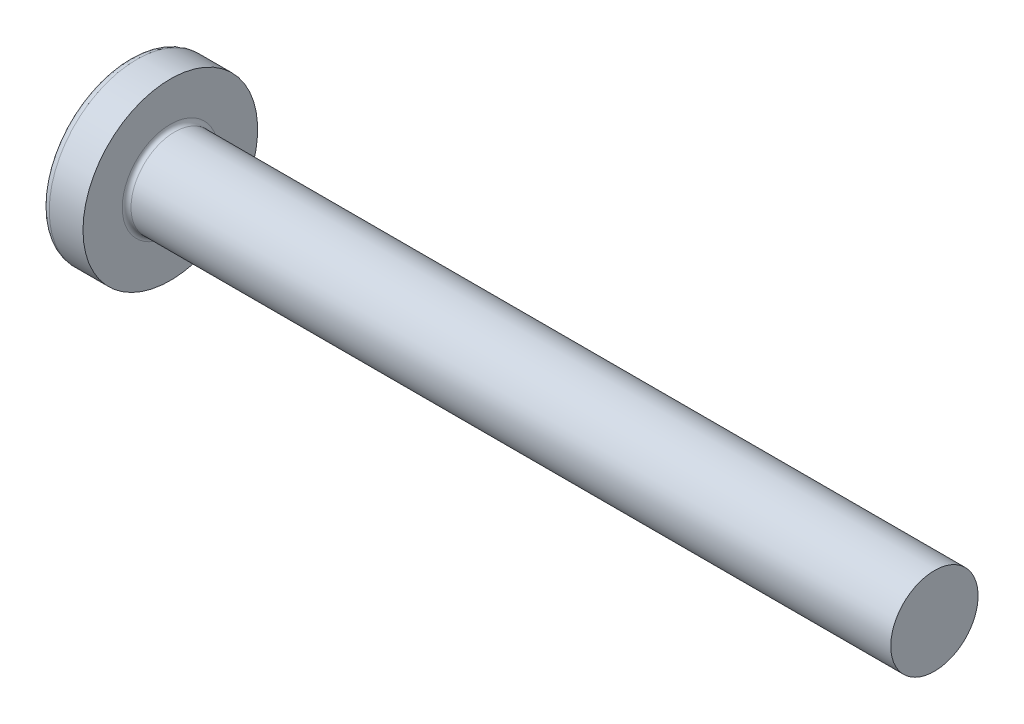
ISO-10303-21;
HEADER;
FILE_DESCRIPTION(('STEP AP214'),'2;1');
FILE_NAME('part.step','',(''),(''),'','','');
FILE_SCHEMA(('AUTOMOTIVE_DESIGN { 1 0 10303 214 1 1 1 1 }'));
ENDSEC;
DATA;
#1=APPLICATION_CONTEXT('core data for automotive mechanical design processes');
#2=APPLICATION_PROTOCOL_DEFINITION('international standard','automotive_design',2000,#1);
#3=PRODUCT_CONTEXT('',#1,'mechanical');
#4=PRODUCT('Part','Part','',(#3));
#5=PRODUCT_RELATED_PRODUCT_CATEGORY('part','',(#4));
#6=PRODUCT_DEFINITION_FORMATION('','',#4);
#7=PRODUCT_DEFINITION_CONTEXT('part definition',#1,'design');
#8=PRODUCT_DEFINITION('design','',#6,#7);
#9=PRODUCT_DEFINITION_SHAPE('','',#8);
#10=(LENGTH_UNIT() NAMED_UNIT(*) SI_UNIT(.MILLI.,.METRE.));
#11=(NAMED_UNIT(*) PLANE_ANGLE_UNIT() SI_UNIT($,.RADIAN.));
#12=(NAMED_UNIT(*) SI_UNIT($,.STERADIAN.) SOLID_ANGLE_UNIT());
#13=UNCERTAINTY_MEASURE_WITH_UNIT(LENGTH_MEASURE(1.E-05),#10,'distance_accuracy_value','');
#14=(GEOMETRIC_REPRESENTATION_CONTEXT(3) GLOBAL_UNCERTAINTY_ASSIGNED_CONTEXT((#13)) GLOBAL_UNIT_ASSIGNED_CONTEXT((#10,
#11,#12)) REPRESENTATION_CONTEXT('',''));
#15=CARTESIAN_POINT('',(0.,0.,0.));
#16=DIRECTION('',(0.,0.,1.));
#17=DIRECTION('',(1.,0.,0.));
#18=AXIS2_PLACEMENT_3D('',#15,#16,#17);
#19=CARTESIAN_POINT('',(6.5,0.,0.));
#20=DIRECTION('',(-1.,0.,0.));
#21=DIRECTION('',(0.,1.,0.));
#22=AXIS2_PLACEMENT_3D('',#19,#20,#21);
#23=SPHERICAL_SURFACE('',#22,6.5);
#24=CARTESIAN_POINT('',(1.26538895452803,0.,0.));
#25=DIRECTION('',(-1.,0.,0.));
#26=DIRECTION('',(0.,0.,1.));
#27=AXIS2_PLACEMENT_3D('',#24,#25,#26);
#28=CIRCLE('',#27,3.85342019543974);
#29=CARTESIAN_POINT('',(1.26538895452803,0.,3.85342019543974));
#30=VERTEX_POINT('',#29);
#31=EDGE_CURVE('E200',#30,#30,#28,.T.);
#32=ORIENTED_EDGE('',*,*,#31,.T.);
#33=EDGE_LOOP('',(#32));
#34=FACE_BOUND('',#33,.T.);
#35=CARTESIAN_POINT('',(0.0788099820016241,0.,0.));
#36=DIRECTION('',(1.,0.,0.));
#37=DIRECTION('',(0.,0.,-1.));
#38=AXIS2_PLACEMENT_3D('',#35,#36,#37);
#39=CIRCLE('',#38,1.0091178091571);
#40=CARTESIAN_POINT('',(0.0788099820016238,-0.515,-0.867809744562728));
#41=VERTEX_POINT('',#40);
#42=CARTESIAN_POINT('',(0.0788099820016241,-0.867809744562729,-0.515));
#43=VERTEX_POINT('',#42);
#44=EDGE_CURVE('E327',#41,#43,#39,.F.);
#45=ORIENTED_EDGE('',*,*,#44,.F.);
#46=CARTESIAN_POINT('',(6.5,-0.515,0.));
#47=DIRECTION('',(0.,1.,0.));
#48=DIRECTION('',(0.,0.,1.));
#49=AXIS2_PLACEMENT_3D('',#46,#47,#48);
#50=CIRCLE('',#49,6.47956595768575);
#51=CARTESIAN_POINT('',(0.331830520157855,-0.514999999999992,-1.98455543332604));
#52=VERTEX_POINT('',#51);
#53=EDGE_CURVE('E260',#52,#41,#50,.T.);
#54=ORIENTED_EDGE('',*,*,#53,.F.);
#55=CARTESIAN_POINT('',(6.06443225879603,0.,0.873613881878154));
#56=DIRECTION('',(0.446197753347436,0.,-0.894934391398443));
#57=DIRECTION('',(-0.894934391398442,0.,-0.446197753347436));
#58=AXIS2_PLACEMENT_3D('',#55,#56,#57);
#59=CIRCLE('',#58,6.42628038045433);
#60=CARTESIAN_POINT('',(0.331830520157855,0.515000000000007,-1.98455543332603));
#61=VERTEX_POINT('',#60);
#62=EDGE_CURVE('E234',#52,#61,#59,.T.);
#63=ORIENTED_EDGE('',*,*,#62,.T.);
#64=CARTESIAN_POINT('',(6.5,0.515,0.));
#65=DIRECTION('',(0.,-1.,0.));
#66=DIRECTION('',(0.,0.,-1.));
#67=AXIS2_PLACEMENT_3D('',#64,#65,#66);
#68=CIRCLE('',#67,6.47956595768575);
#69=CARTESIAN_POINT('',(0.0788099820016249,0.515,-0.867809744562724));
#70=VERTEX_POINT('',#69);
#71=EDGE_CURVE('E289',#70,#61,#68,.T.);
#72=ORIENTED_EDGE('',*,*,#71,.F.);
#73=CARTESIAN_POINT('',(0.0788099820016241,0.867809744562719,-0.515));
#74=VERTEX_POINT('',#73);
#75=EDGE_CURVE('E342',#74,#70,#39,.F.);
#76=ORIENTED_EDGE('',*,*,#75,.F.);
#77=CARTESIAN_POINT('',(6.5,0.,-0.515));
#78=DIRECTION('',(0.,0.,1.));
#79=DIRECTION('',(1.,0.,0.));
#80=AXIS2_PLACEMENT_3D('',#77,#78,#79);
#81=CIRCLE('',#80,6.47956595768575);
#82=CARTESIAN_POINT('',(0.331830520157856,1.98455543332604,-0.515));
#83=VERTEX_POINT('',#82);
#84=EDGE_CURVE('E228',#83,#74,#81,.T.);
#85=ORIENTED_EDGE('',*,*,#84,.F.);
#86=CARTESIAN_POINT('',(6.06443225879604,-0.873613881878154,0.));
#87=DIRECTION('',(0.446197753347436,0.894934391398443,0.));
#88=DIRECTION('',(-0.894934391398443,0.446197753347436,0.));
#89=AXIS2_PLACEMENT_3D('',#86,#87,#88);
#90=CIRCLE('',#89,6.42628038045433);
#91=CARTESIAN_POINT('',(0.331830520157856,1.98455543332604,0.515));
#92=VERTEX_POINT('',#91);
#93=EDGE_CURVE('E231',#83,#92,#90,.T.);
#94=ORIENTED_EDGE('',*,*,#93,.T.);
#95=CARTESIAN_POINT('',(6.5,0.,0.515));
#96=DIRECTION('',(0.,0.,-1.));
#97=DIRECTION('',(0.,1.,0.));
#98=AXIS2_PLACEMENT_3D('',#95,#96,#97);
#99=CIRCLE('',#98,6.47956595768575);
#100=CARTESIAN_POINT('',(0.0788099820016241,0.867809744562719,0.515));
#101=VERTEX_POINT('',#100);
#102=EDGE_CURVE('E224',#101,#92,#99,.T.);
#103=ORIENTED_EDGE('',*,*,#102,.F.);
#104=CARTESIAN_POINT('',(0.0788099820016247,0.515,0.867809744562727));
#105=VERTEX_POINT('',#104);
#106=EDGE_CURVE('E341',#105,#101,#39,.F.);
#107=ORIENTED_EDGE('',*,*,#106,.F.);
#108=CARTESIAN_POINT('',(0.331830520157856,0.514999999999993,1.98455543332604));
#109=VERTEX_POINT('',#108);
#110=EDGE_CURVE('E244',#109,#105,#68,.T.);
#111=ORIENTED_EDGE('',*,*,#110,.F.);
#112=CARTESIAN_POINT('',(6.06443225879604,0.,-0.873613881878152));
#113=DIRECTION('',(0.446197753347436,0.,0.894934391398443));
#114=DIRECTION('',(0.894934391398443,0.,-0.446197753347436));
#115=AXIS2_PLACEMENT_3D('',#112,#113,#114);
#116=CIRCLE('',#115,6.42628038045433);
#117=CARTESIAN_POINT('',(0.331830520157855,-0.515000000000006,1.98455543332603));
#118=VERTEX_POINT('',#117);
#119=EDGE_CURVE('E31',#109,#118,#116,.T.);
#120=ORIENTED_EDGE('',*,*,#119,.T.);
#121=CARTESIAN_POINT('',(0.0788099820016244,-0.515,0.867809744562724));
#122=VERTEX_POINT('',#121);
#123=EDGE_CURVE('E241',#122,#118,#50,.T.);
#124=ORIENTED_EDGE('',*,*,#123,.F.);
#125=CARTESIAN_POINT('',(0.0788099820016241,-0.867809744562729,0.515));
#126=VERTEX_POINT('',#125);
#127=EDGE_CURVE('E377',#126,#122,#39,.F.);
#128=ORIENTED_EDGE('',*,*,#127,.F.);
#129=CARTESIAN_POINT('',(0.331830520157854,-1.98455543332603,0.515));
#130=VERTEX_POINT('',#129);
#131=EDGE_CURVE('E225',#130,#126,#99,.T.);
#132=ORIENTED_EDGE('',*,*,#131,.F.);
#133=CARTESIAN_POINT('',(6.06443225879603,0.873613881878153,0.));
#134=DIRECTION('',(0.446197753347436,-0.894934391398443,0.));
#135=DIRECTION('',(0.894934391398442,0.446197753347436,0.));
#136=AXIS2_PLACEMENT_3D('',#133,#134,#135);
#137=CIRCLE('',#136,6.42628038045433);
#138=CARTESIAN_POINT('',(0.331830520157854,-1.98455543332604,-0.515));
#139=VERTEX_POINT('',#138);
#140=EDGE_CURVE('E221',#130,#139,#137,.T.);
#141=ORIENTED_EDGE('',*,*,#140,.T.);
#142=EDGE_CURVE('E46',#43,#139,#81,.T.);
#143=ORIENTED_EDGE('',*,*,#142,.F.);
#144=EDGE_LOOP('',(#45,#54,#63,#72,#76,#85,#94,#103,#107,#111,#120,#124,#128,#132,#141,#143));
#145=FACE_BOUND('',#144,.T.);
#146=ADVANCED_FACE('F17',(#34,#145),#23,.T.);
#147=CARTESIAN_POINT('',(0.,2.15,-0.515));
#148=DIRECTION('',(0.,0.,1.));
#149=DIRECTION('',(1.,0.,0.));
#150=AXIS2_PLACEMENT_3D('',#147,#148,#149);
#151=PLANE('',#150);
#152=ORIENTED_EDGE('',*,*,#84,.T.);
#153=CARTESIAN_POINT('',(-1.51195208675157,0.994972220320188,-0.515));
#154=CARTESIAN_POINT('',(-1.2040598194928,0.970722016949957,-0.515));
#155=CARTESIAN_POINT('',(-0.896180907521175,0.94629910991965,-0.515));
#156=CARTESIAN_POINT('',(-0.280449079832186,0.896981122427852,-0.515));
#157=CARTESIAN_POINT('',(0.027403834439687,0.872086023934884,-0.515));
#158=CARTESIAN_POINT('',(0.489146739515351,0.834295535195281,-0.515));
#159=CARTESIAN_POINT('',(0.643055047553847,0.821624058404092,-0.515));
#160=CARTESIAN_POINT('',(0.950856520197142,0.796108332639504,-0.515));
#161=CARTESIAN_POINT('',(1.10474968487868,0.783264084592465,-0.515));
#162=CARTESIAN_POINT('',(1.41251352095103,0.757376569093378,-0.515));
#163=CARTESIAN_POINT('',(1.56638419296577,0.744333309065218,-0.515));
#164=CARTESIAN_POINT('',(1.87410847343336,0.718013273188896,-0.515));
#165=CARTESIAN_POINT('',(2.02796208151372,0.704736492982792,-0.515));
#166=CARTESIAN_POINT('',(2.36455311890989,0.675386943006726,-0.515));
#167=CARTESIAN_POINT('',(2.54728562293342,0.659257575640986,-0.515));
#168=CARTESIAN_POINT('',(2.91270624109256,0.626517182479887,-0.515));
#169=CARTESIAN_POINT('',(3.09539435554038,0.609906160177238,-0.515));
#170=CARTESIAN_POINT('',(3.46069832191613,0.576073027116421,-0.515));
#171=CARTESIAN_POINT('',(3.64331417870068,0.558850968932727,-0.515));
#172=CARTESIAN_POINT('',(4.00847437496567,0.523604864540037,-0.515));
#173=CARTESIAN_POINT('',(4.19101871216888,0.505580794604253,-0.515));
#174=CARTESIAN_POINT('',(4.55606208157937,0.468429191666488,-0.515));
#175=CARTESIAN_POINT('',(4.73856107358023,0.449301262281853,-0.515));
#176=CARTESIAN_POINT('',(5.10337547353419,0.409473604748924,-0.515));
#177=CARTESIAN_POINT('',(5.28569089526422,0.388774005106069,-0.515));
#178=CARTESIAN_POINT('',(5.55897278495412,0.355828287527264,-0.515));
#179=CARTESIAN_POINT('',(5.65005277419686,0.344527918782738,-0.515));
#180=CARTESIAN_POINT('',(5.83209904103608,0.321075174263031,-0.515));
#181=CARTESIAN_POINT('',(5.92306532397915,0.308922840209685,-0.515));
#182=CARTESIAN_POINT('',(6.10486078872898,0.283427334451929,-0.515));
#183=CARTESIAN_POINT('',(6.1956899229938,0.270083817601714,-0.515));
#184=CARTESIAN_POINT('',(6.3317277378568,0.24870142080995,-0.515));
#185=CARTESIAN_POINT('',(6.37704304473344,0.241345446705303,-0.515));
#186=CARTESIAN_POINT('',(6.4675722520141,0.226018953559337,-0.515));
#187=CARTESIAN_POINT('',(6.51278614568083,0.218048394864476,-0.515));
#188=CARTESIAN_POINT('',(6.55793125759549,0.209691465274944,-0.515));
#189=B_SPLINE_CURVE_WITH_KNOTS('',3,(#153,#154,#155,#156,#157,#158,#159,#160,#161,#162,#163,
#164,#165,#166,#167,#168,#169,#170,#171,#172,#173,#174,#175,#176,#177,#178,#179,#180,#181,#182,
#183,#184,#185,#186,#187,#188),.UNSPECIFIED.,.F.,.F.,(4,2,2,2,2,2,2,2,2,2,2,2,2,2,2,2,2,4),(0.,
0.926537709781722,1.85311087258339,2.31639796016285,2.77968256468771,3.24294992902055,
3.70622594801777,4.25655436065378,4.80687878359544,5.35715597005738,5.90744944680718,
6.45794177197674,7.008389135274,7.28372117336899,7.55903973750591,7.83443833587749,
7.97216007460855,8.10989070671572),.UNSPECIFIED.);
#190=CARTESIAN_POINT('',(2.34,0.677477674908923,-0.515));
#191=VERTEX_POINT('',#190);
#192=EDGE_CURVE('E364',#74,#191,#189,.T.);
#193=ORIENTED_EDGE('',*,*,#192,.T.);
#194=DIRECTION('',(0.,1.,0.));
#195=VECTOR('',#194,1.);
#196=CARTESIAN_POINT('',(2.34,-0.983319232260742,-0.515));
#197=LINE('',#196,#195);
#198=CARTESIAN_POINT('',(2.34,0.983319232260742,-0.515));
#199=VERTEX_POINT('',#198);
#200=EDGE_CURVE('E310',#191,#199,#197,.T.);
#201=ORIENTED_EDGE('',*,*,#200,.T.);
#202=DIRECTION('',(0.894934391398442,-0.446197753347436,0.));
#203=VECTOR('',#202,1.);
#204=CARTESIAN_POINT('',(0.,2.15,-0.515));
#205=LINE('',#204,#203);
#206=EDGE_CURVE('E201',#83,#199,#205,.T.);
#207=ORIENTED_EDGE('',*,*,#206,.F.);
#208=EDGE_LOOP('',(#152,#193,#201,#207));
#209=FACE_BOUND('',#208,.T.);
#210=ADVANCED_FACE('F154',(#209),#151,.T.);
#211=CARTESIAN_POINT('',(2.34,-0.983319232260742,-0.515));
#212=VERTEX_POINT('',#211);
#213=CARTESIAN_POINT('',(2.34,-0.677477674908923,-0.515));
#214=VERTEX_POINT('',#213);
#215=EDGE_CURVE('E209',#212,#214,#197,.T.);
#216=ORIENTED_EDGE('',*,*,#215,.T.);
#217=CARTESIAN_POINT('',(-1.51195208675157,-0.994972220320188,-0.515));
#218=CARTESIAN_POINT('',(-1.2040598194928,-0.970722016949959,-0.515));
#219=CARTESIAN_POINT('',(-0.896180907521175,-0.946299109919651,-0.515));
#220=CARTESIAN_POINT('',(-0.280449079832186,-0.896981122427851,-0.515));
#221=CARTESIAN_POINT('',(0.0274038344396864,-0.872086023934882,-0.515));
#222=CARTESIAN_POINT('',(0.48914673951535,-0.83429553519528,-0.515));
#223=CARTESIAN_POINT('',(0.643055047553846,-0.821624058404092,-0.515));
#224=CARTESIAN_POINT('',(0.950856520197141,-0.796108332639504,-0.515));
#225=CARTESIAN_POINT('',(1.10474968487868,-0.783264084592465,-0.515));
#226=CARTESIAN_POINT('',(1.41251352095103,-0.757376569093378,-0.515));
#227=CARTESIAN_POINT('',(1.56638419296577,-0.744333309065218,-0.515));
#228=CARTESIAN_POINT('',(1.87410847343336,-0.718013273188896,-0.515));
#229=CARTESIAN_POINT('',(2.02796208151372,-0.704736492982792,-0.515));
#230=CARTESIAN_POINT('',(2.36455311890989,-0.675386943006726,-0.515));
#231=CARTESIAN_POINT('',(2.54728562293342,-0.659257575640986,-0.515));
#232=CARTESIAN_POINT('',(2.91270624109256,-0.626517182479887,-0.515));
#233=CARTESIAN_POINT('',(3.09539435554038,-0.609906160177238,-0.515));
#234=CARTESIAN_POINT('',(3.46069832191613,-0.576073027116421,-0.515));
#235=CARTESIAN_POINT('',(3.64331417870069,-0.558850968932727,-0.515));
#236=CARTESIAN_POINT('',(4.00847437496568,-0.523604864540037,-0.515));
#237=CARTESIAN_POINT('',(4.19101871216889,-0.505580794604252,-0.515));
#238=CARTESIAN_POINT('',(4.55606208157938,-0.468429191666487,-0.515));
#239=CARTESIAN_POINT('',(4.73856107358023,-0.449301262281853,-0.515));
#240=CARTESIAN_POINT('',(5.10337547353419,-0.409473604748924,-0.515));
#241=CARTESIAN_POINT('',(5.28569089526422,-0.388774005106069,-0.515));
#242=CARTESIAN_POINT('',(5.55897278495412,-0.355828287527263,-0.515));
#243=CARTESIAN_POINT('',(5.65005277419686,-0.344527918782738,-0.515));
#244=CARTESIAN_POINT('',(5.83209904103608,-0.32107517426303,-0.515));
#245=CARTESIAN_POINT('',(5.92306532397915,-0.308922840209685,-0.515));
#246=CARTESIAN_POINT('',(6.10486078872898,-0.283427334451929,-0.515));
#247=CARTESIAN_POINT('',(6.1956899229938,-0.270083817601714,-0.515));
#248=CARTESIAN_POINT('',(6.3317277378568,-0.24870142080995,-0.515));
#249=CARTESIAN_POINT('',(6.37704304473344,-0.241345446705303,-0.515));
#250=CARTESIAN_POINT('',(6.4675722520141,-0.226018953559337,-0.515));
#251=CARTESIAN_POINT('',(6.51278614568083,-0.218048394864476,-0.515));
#252=CARTESIAN_POINT('',(6.55793125759549,-0.209691465274944,-0.515));
#253=B_SPLINE_CURVE_WITH_KNOTS('',3,(#217,#218,#219,#220,#221,#222,#223,#224,#225,#226,#227,
#228,#229,#230,#231,#232,#233,#234,#235,#236,#237,#238,#239,#240,#241,#242,#243,#244,#245,#246,
#247,#248,#249,#250,#251,#252),.UNSPECIFIED.,.F.,.F.,(4,2,2,2,2,2,2,2,2,2,2,2,2,2,2,2,2,4),(0.,
0.926537709781722,1.85311087258339,2.31639796016285,2.77968256468771,3.24294992902055,
3.70622594801777,4.25655436065379,4.80687878359544,5.35715597005739,5.90744944680719,
6.45794177197674,7.008389135274,7.28372117336899,7.55903973750591,7.83443833587749,
7.97216007460855,8.10989070671572),.UNSPECIFIED.);
#254=EDGE_CURVE('E340',#214,#43,#253,.F.);
#255=ORIENTED_EDGE('',*,*,#254,.T.);
#256=ORIENTED_EDGE('',*,*,#142,.T.);
#257=DIRECTION('',(0.894934391398442,0.446197753347436,0.));
#258=VECTOR('',#257,1.);
#259=CARTESIAN_POINT('',(0.,-2.15,-0.515));
#260=LINE('',#259,#258);
#261=EDGE_CURVE('E292',#139,#212,#260,.T.);
#262=ORIENTED_EDGE('',*,*,#261,.T.);
#263=EDGE_LOOP('',(#216,#255,#256,#262));
#264=FACE_BOUND('',#263,.T.);
#265=ADVANCED_FACE('F161',(#264),#151,.T.);
#266=CARTESIAN_POINT('',(0.,-2.15,0.515));
#267=DIRECTION('',(0.,0.,-1.));
#268=DIRECTION('',(0.,1.,0.));
#269=AXIS2_PLACEMENT_3D('',#266,#267,#268);
#270=PLANE('',#269);
#271=DIRECTION('',(0.,-1.,0.));
#272=VECTOR('',#271,1.);
#273=CARTESIAN_POINT('',(2.34,0.983319232260743,0.515));
#274=LINE('',#273,#272);
#275=CARTESIAN_POINT('',(2.34,0.983319232260743,0.515));
#276=VERTEX_POINT('',#275);
#277=CARTESIAN_POINT('',(2.34,0.677477674908923,0.515));
#278=VERTEX_POINT('',#277);
#279=EDGE_CURVE('E300',#276,#278,#274,.T.);
#280=ORIENTED_EDGE('',*,*,#279,.T.);
#281=CARTESIAN_POINT('',(-1.51195208754038,0.994972220382298,0.515));
#282=CARTESIAN_POINT('',(-1.20405982018868,0.970722017005063,0.515000000000001));
#283=CARTESIAN_POINT('',(-0.896180908124145,0.946299109967688,0.515000000000001));
#284=CARTESIAN_POINT('',(-0.280449080249312,0.896981122461527,0.515));
#285=CARTESIAN_POINT('',(0.0274038341154852,0.872086023961265,0.515));
#286=CARTESIAN_POINT('',(0.489146739371409,0.834295535207136,0.515));
#287=CARTESIAN_POINT('',(0.643055047497245,0.821624058408795,0.515));
#288=CARTESIAN_POINT('',(0.950856520315204,0.796108332629705,0.515000000000001));
#289=CARTESIAN_POINT('',(1.10474968508407,0.783264084575317,0.515000000000001));
#290=CARTESIAN_POINT('',(1.41251352133103,0.757376569061287,0.515000000000001));
#291=CARTESIAN_POINT('',(1.56638419343305,0.744333309025533,0.515000000000001));
#292=CARTESIAN_POINT('',(1.87410847407519,0.718013273133715,0.515));
#293=CARTESIAN_POINT('',(2.02796208224283,0.70473649291971,0.515));
#294=CARTESIAN_POINT('',(2.36455311972626,0.675386942934956,0.515));
#295=CARTESIAN_POINT('',(2.54728562374981,0.659257575568568,0.515));
#296=CARTESIAN_POINT('',(2.91270624190895,0.626517182406012,0.515000000000001));
#297=CARTESIAN_POINT('',(3.09539435635676,0.609906160102554,0.515000000000001));
#298=CARTESIAN_POINT('',(3.46069832273244,0.576073027039889,0.515000000000001));
#299=CARTESIAN_POINT('',(3.64331417951694,0.558850968855156,0.515000000000001));
#300=CARTESIAN_POINT('',(4.00847437578178,0.523604864460043,0.515000000000001));
#301=CARTESIAN_POINT('',(4.1910187129849,0.505580794522875,0.515000000000001));
#302=CARTESIAN_POINT('',(4.55606208239526,0.468429191581779,0.515000000000001));
#303=CARTESIAN_POINT('',(4.73856107439606,0.449301262195196,0.515000000000001));
#304=CARTESIAN_POINT('',(5.10337547434978,0.409473604657434,0.515000000000001));
#305=CARTESIAN_POINT('',(5.28569089607961,0.388774005011694,0.515000000000001));
#306=CARTESIAN_POINT('',(5.55897278576906,0.355828287427081,0.515000000000001));
#307=CARTESIAN_POINT('',(5.65005277501166,0.344527918680367,0.515000000000001));
#308=CARTESIAN_POINT('',(5.83209904185046,0.321075174155498,0.515000000000001));
#309=CARTESIAN_POINT('',(5.92306532479326,0.308922840099179,0.515000000000001));
#310=CARTESIAN_POINT('',(6.10486078954238,0.283427334334151,0.515000000000001));
#311=CARTESIAN_POINT('',(6.19568992380676,0.270083817479635,0.515000000000001));
#312=CARTESIAN_POINT('',(6.33172773866874,0.248701420679477,0.515000000000001));
#313=CARTESIAN_POINT('',(6.377043045545,0.241345446571705,0.515000000000001));
#314=CARTESIAN_POINT('',(6.46757225282466,0.226018953418421,0.515000000000001));
#315=CARTESIAN_POINT('',(6.51278614649077,0.218048394719367,0.515000000000001));
#316=CARTESIAN_POINT('',(6.55793125840465,0.209691465124901,0.515));
#317=B_SPLINE_CURVE_WITH_KNOTS('',3,(#281,#282,#283,#284,#285,#286,#287,#288,#289,#290,#291,
#292,#293,#294,#295,#296,#297,#298,#299,#300,#301,#302,#303,#304,#305,#306,#307,#308,#309,#310,
#311,#312,#313,#314,#315,#316),.UNSPECIFIED.,.F.,.F.,(4,2,2,2,2,2,2,2,2,2,2,2,2,2,2,2,2,4),(0.,
0.926537710061279,1.85311087314258,2.31639796098494,2.77968256577269,3.24294993036838,
3.70622594962848,4.2565543622647,4.80687878520655,5.3571559716686,5.90744944841855,
6.45794177358856,7.00838913688619,7.28372117498157,7.55903973911884,7.83443833749096,
7.97216007622236,8.1098907083299),.UNSPECIFIED.);
#318=EDGE_CURVE('E265',#278,#101,#317,.F.);
#319=ORIENTED_EDGE('',*,*,#318,.T.);
#320=ORIENTED_EDGE('',*,*,#102,.T.);
#321=DIRECTION('',(0.894934391398443,-0.446197753347436,0.));
#322=VECTOR('',#321,1.);
#323=CARTESIAN_POINT('',(0.,2.15,0.515));
#324=LINE('',#323,#322);
#325=EDGE_CURVE('E206',#92,#276,#324,.T.);
#326=ORIENTED_EDGE('',*,*,#325,.T.);
#327=EDGE_LOOP('',(#280,#319,#320,#326));
#328=FACE_BOUND('',#327,.T.);
#329=ADVANCED_FACE('F360',(#328),#270,.T.);
#330=ORIENTED_EDGE('',*,*,#131,.T.);
#331=CARTESIAN_POINT('',(-1.51195208754038,-0.994972220382298,0.515));
#332=CARTESIAN_POINT('',(-1.20405982018868,-0.970722017005063,0.515));
#333=CARTESIAN_POINT('',(-0.896180908124145,-0.946299109967688,0.515));
#334=CARTESIAN_POINT('',(-0.280449080249313,-0.896981122461527,0.515));
#335=CARTESIAN_POINT('',(0.0274038341154843,-0.872086023961265,0.515));
#336=CARTESIAN_POINT('',(0.489146739371408,-0.834295535207136,0.515));
#337=CARTESIAN_POINT('',(0.643055047497244,-0.821624058408796,0.515));
#338=CARTESIAN_POINT('',(0.950856520315203,-0.796108332629705,0.515));
#339=CARTESIAN_POINT('',(1.10474968508407,-0.783264084575317,0.515));
#340=CARTESIAN_POINT('',(1.41251352133103,-0.757376569061287,0.515));
#341=CARTESIAN_POINT('',(1.56638419343305,-0.744333309025533,0.515000000000001));
#342=CARTESIAN_POINT('',(1.87410847407519,-0.718013273133716,0.515));
#343=CARTESIAN_POINT('',(2.02796208224283,-0.70473649291971,0.515));
#344=CARTESIAN_POINT('',(2.36455311972626,-0.675386942934956,0.515));
#345=CARTESIAN_POINT('',(2.5472856237498,-0.659257575568568,0.515));
#346=CARTESIAN_POINT('',(2.91270624190895,-0.626517182406013,0.515000000000001));
#347=CARTESIAN_POINT('',(3.09539435635676,-0.609906160102554,0.515000000000001));
#348=CARTESIAN_POINT('',(3.46069832273244,-0.576073027039889,0.515000000000001));
#349=CARTESIAN_POINT('',(3.64331417951694,-0.558850968855156,0.515000000000001));
#350=CARTESIAN_POINT('',(4.00847437578178,-0.523604864460043,0.515000000000001));
#351=CARTESIAN_POINT('',(4.19101871298491,-0.505580794522875,0.515000000000001));
#352=CARTESIAN_POINT('',(4.55606208239526,-0.468429191581779,0.515000000000001));
#353=CARTESIAN_POINT('',(4.73856107439607,-0.449301262195196,0.515000000000001));
#354=CARTESIAN_POINT('',(5.10337547434978,-0.409473604657433,0.515000000000001));
#355=CARTESIAN_POINT('',(5.28569089607961,-0.388774005011694,0.515000000000001));
#356=CARTESIAN_POINT('',(5.55897278576906,-0.355828287427081,0.515000000000001));
#357=CARTESIAN_POINT('',(5.65005277501166,-0.344527918680367,0.515000000000001));
#358=CARTESIAN_POINT('',(5.83209904185047,-0.321075174155498,0.515000000000001));
#359=CARTESIAN_POINT('',(5.92306532479326,-0.308922840099179,0.515000000000001));
#360=CARTESIAN_POINT('',(6.10486078954238,-0.283427334334151,0.515000000000001));
#361=CARTESIAN_POINT('',(6.19568992380676,-0.270083817479635,0.515000000000001));
#362=CARTESIAN_POINT('',(6.33172773866874,-0.248701420679477,0.515000000000001));
#363=CARTESIAN_POINT('',(6.377043045545,-0.241345446571705,0.515000000000001));
#364=CARTESIAN_POINT('',(6.46757225282466,-0.226018953418421,0.515000000000001));
#365=CARTESIAN_POINT('',(6.51278614649077,-0.218048394719367,0.515000000000001));
#366=CARTESIAN_POINT('',(6.55793125840465,-0.209691465124901,0.515));
#367=B_SPLINE_CURVE_WITH_KNOTS('',3,(#331,#332,#333,#334,#335,#336,#337,#338,#339,#340,#341,
#342,#343,#344,#345,#346,#347,#348,#349,#350,#351,#352,#353,#354,#355,#356,#357,#358,#359,#360,
#361,#362,#363,#364,#365,#366),.UNSPECIFIED.,.F.,.F.,(4,2,2,2,2,2,2,2,2,2,2,2,2,2,2,2,2,4),(0.,
0.926537710061279,1.85311087314258,2.31639796098494,2.77968256577269,3.24294993036838,
3.70622594962848,4.2565543622647,4.80687878520655,5.35715597166861,5.90744944841855,
6.45794177358857,7.00838913688619,7.28372117498157,7.55903973911884,7.83443833749096,
7.97216007622236,8.1098907083299),.UNSPECIFIED.);
#368=CARTESIAN_POINT('',(2.34,-0.677477674908923,0.515));
#369=VERTEX_POINT('',#368);
#370=EDGE_CURVE('E378',#126,#369,#367,.T.);
#371=ORIENTED_EDGE('',*,*,#370,.T.);
#372=CARTESIAN_POINT('',(2.34,-0.983319232260742,0.515));
#373=VERTEX_POINT('',#372);
#374=EDGE_CURVE('E302',#369,#373,#274,.T.);
#375=ORIENTED_EDGE('',*,*,#374,.T.);
#376=DIRECTION('',(0.894934391398442,0.446197753347436,0.));
#377=VECTOR('',#376,1.);
#378=CARTESIAN_POINT('',(0.,-2.15,0.515));
#379=LINE('',#378,#377);
#380=EDGE_CURVE('E294',#130,#373,#379,.T.);
#381=ORIENTED_EDGE('',*,*,#380,.F.);
#382=EDGE_LOOP('',(#330,#371,#375,#381));
#383=FACE_BOUND('',#382,.T.);
#384=ADVANCED_FACE('F411',(#383),#270,.T.);
#385=CARTESIAN_POINT('',(2.34,0.983319232260742,-0.515));
#386=DIRECTION('',(-1.,0.,0.));
#387=DIRECTION('',(0.,0.,1.));
#388=AXIS2_PLACEMENT_3D('',#385,#386,#387);
#389=PLANE('',#388);
#390=ORIENTED_EDGE('',*,*,#374,.F.);
#391=CARTESIAN_POINT('',(2.34,0.,0.));
#392=DIRECTION('',(-1.,0.,0.));
#393=DIRECTION('',(0.,0.,1.));
#394=AXIS2_PLACEMENT_3D('',#391,#392,#393);
#395=CIRCLE('',#394,0.851);
#396=EDGE_CURVE('E335',#214,#369,#395,.T.);
#397=ORIENTED_EDGE('',*,*,#396,.F.);
#398=ORIENTED_EDGE('',*,*,#215,.F.);
#399=DIRECTION('',(0.,0.,1.));
#400=VECTOR('',#399,1.);
#401=CARTESIAN_POINT('',(2.34,-0.983319232260742,-0.515));
#402=LINE('',#401,#400);
#403=EDGE_CURVE('E297',#212,#373,#402,.T.);
#404=ORIENTED_EDGE('',*,*,#403,.T.);
#405=EDGE_LOOP('',(#390,#397,#398,#404));
#406=FACE_BOUND('',#405,.T.);
#407=ADVANCED_FACE('F403',(#406),#389,.T.);
#408=DIRECTION('',(0.,0.,-1.));
#409=VECTOR('',#408,1.);
#410=CARTESIAN_POINT('',(2.34,-0.515,0.983319232260741));
#411=LINE('',#410,#409);
#412=CARTESIAN_POINT('',(2.34,-0.515,-0.677477674908925));
#413=VERTEX_POINT('',#412);
#414=CARTESIAN_POINT('',(2.34,-0.515,-0.983319232260744));
#415=VERTEX_POINT('',#414);
#416=EDGE_CURVE('E283',#413,#415,#411,.T.);
#417=ORIENTED_EDGE('',*,*,#416,.F.);
#418=CARTESIAN_POINT('',(2.34,0.515,-0.677477674908921));
#419=VERTEX_POINT('',#418);
#420=EDGE_CURVE('E38',#419,#413,#395,.T.);
#421=ORIENTED_EDGE('',*,*,#420,.F.);
#422=DIRECTION('',(0.,0.,1.));
#423=VECTOR('',#422,1.);
#424=CARTESIAN_POINT('',(2.34,0.515,-0.98331923226074));
#425=LINE('',#424,#423);
#426=CARTESIAN_POINT('',(2.34,0.515,-0.98331923226074));
#427=VERTEX_POINT('',#426);
#428=EDGE_CURVE('E286',#427,#419,#425,.T.);
#429=ORIENTED_EDGE('',*,*,#428,.F.);
#430=DIRECTION('',(0.,-1.,0.));
#431=VECTOR('',#430,1.);
#432=CARTESIAN_POINT('',(2.34,0.515,-0.98331923226074));
#433=LINE('',#432,#431);
#434=EDGE_CURVE('E277',#427,#415,#433,.T.);
#435=ORIENTED_EDGE('',*,*,#434,.T.);
#436=EDGE_LOOP('',(#417,#421,#429,#435));
#437=FACE_BOUND('',#436,.T.);
#438=ADVANCED_FACE('F330',(#437),#389,.T.);
#439=ORIENTED_EDGE('',*,*,#200,.F.);
#440=EDGE_CURVE('E334',#278,#191,#395,.T.);
#441=ORIENTED_EDGE('',*,*,#440,.F.);
#442=ORIENTED_EDGE('',*,*,#279,.F.);
#443=DIRECTION('',(0.,0.,-1.));
#444=VECTOR('',#443,1.);
#445=CARTESIAN_POINT('',(2.34,0.983319232260743,0.515));
#446=LINE('',#445,#444);
#447=EDGE_CURVE('E303',#276,#199,#446,.T.);
#448=ORIENTED_EDGE('',*,*,#447,.T.);
#449=EDGE_LOOP('',(#439,#441,#442,#448));
#450=FACE_BOUND('',#449,.T.);
#451=ADVANCED_FACE('F404',(#450),#389,.T.);
#452=CARTESIAN_POINT('',(0.,0.514999999999993,2.15));
#453=DIRECTION('',(0.,-1.,0.));
#454=DIRECTION('',(1.,0.,0.));
#455=AXIS2_PLACEMENT_3D('',#452,#453,#454);
#456=PLANE('',#455);
#457=ORIENTED_EDGE('',*,*,#110,.T.);
#458=CARTESIAN_POINT('',(-1.51195208754038,0.515,0.994972220382299));
#459=CARTESIAN_POINT('',(-1.20405982018868,0.514999999999995,0.970722017005064));
#460=CARTESIAN_POINT('',(-0.896180908124144,0.514999999999996,0.946299109967689));
#461=CARTESIAN_POINT('',(-0.280449080249312,0.514999999999999,0.896981122461529));
#462=CARTESIAN_POINT('',(0.0274038341154853,0.515000000000001,0.872086023961267));
#463=CARTESIAN_POINT('',(0.489146739371409,0.514999999999999,0.834295535207138));
#464=CARTESIAN_POINT('',(0.643055047497245,0.514999999999998,0.821624058408797));
#465=CARTESIAN_POINT('',(0.950856520315204,0.514999999999997,0.796108332629707));
#466=CARTESIAN_POINT('',(1.10474968508407,0.514999999999998,0.783264084575319));
#467=CARTESIAN_POINT('',(1.41251352133103,0.514999999999998,0.757376569061289));
#468=CARTESIAN_POINT('',(1.56638419343305,0.514999999999997,0.744333309025535));
#469=CARTESIAN_POINT('',(1.87410847407519,0.514999999999999,0.718013273133717));
#470=CARTESIAN_POINT('',(2.02796208224283,0.515,0.704736492919711));
#471=CARTESIAN_POINT('',(2.36455311972626,0.515,0.675386942934957));
#472=CARTESIAN_POINT('',(2.54728562374981,0.514999999999999,0.659257575568569));
#473=CARTESIAN_POINT('',(2.91270624190895,0.514999999999998,0.626517182406015));
#474=CARTESIAN_POINT('',(3.09539435635676,0.514999999999998,0.609906160102556));
#475=CARTESIAN_POINT('',(3.46069832273244,0.514999999999999,0.57607302703989));
#476=CARTESIAN_POINT('',(3.64331417951694,0.514999999999999,0.558850968855158));
#477=CARTESIAN_POINT('',(4.00847437578178,0.514999999999999,0.523604864460045));
#478=CARTESIAN_POINT('',(4.1910187129849,0.514999999999999,0.505580794522877));
#479=CARTESIAN_POINT('',(4.55606208239526,0.514999999999999,0.468429191581781));
#480=CARTESIAN_POINT('',(4.73856107439606,0.514999999999999,0.449301262195199));
#481=CARTESIAN_POINT('',(5.10337547434978,0.514999999999999,0.409473604657436));
#482=CARTESIAN_POINT('',(5.28569089607961,0.514999999999999,0.388774005011696));
#483=CARTESIAN_POINT('',(5.55897278576906,0.514999999999999,0.355828287427083));
#484=CARTESIAN_POINT('',(5.65005277501166,0.514999999999999,0.344527918680369));
#485=CARTESIAN_POINT('',(5.83209904185047,0.514999999999999,0.321075174155501));
#486=CARTESIAN_POINT('',(5.92306532479326,0.514999999999999,0.308922840099181));
#487=CARTESIAN_POINT('',(6.10486078954238,0.514999999999999,0.283427334334153));
#488=CARTESIAN_POINT('',(6.19568992380676,0.515,0.270083817479638));
#489=CARTESIAN_POINT('',(6.33172773866874,0.515,0.24870142067948));
#490=CARTESIAN_POINT('',(6.377043045545,0.515,0.241345446571708));
#491=CARTESIAN_POINT('',(6.46757225282466,0.515,0.226018953418424));
#492=CARTESIAN_POINT('',(6.51278614649077,0.515,0.21804839471937));
#493=CARTESIAN_POINT('',(6.55793125840465,0.515,0.209691465124904));
#494=B_SPLINE_CURVE_WITH_KNOTS('',3,(#458,#459,#460,#461,#462,#463,#464,#465,#466,#467,#468,
#469,#470,#471,#472,#473,#474,#475,#476,#477,#478,#479,#480,#481,#482,#483,#484,#485,#486,#487,
#488,#489,#490,#491,#492,#493),.UNSPECIFIED.,.F.,.F.,(4,2,2,2,2,2,2,2,2,2,2,2,2,2,2,2,2,4),(0.,
0.92653771006128,1.85311087314258,2.31639796098494,2.77968256577269,3.24294993036838,
3.70622594962848,4.2565543622647,4.80687878520655,5.3571559716686,5.90744944841855,
6.45794177358856,7.00838913688619,7.28372117498157,7.55903973911884,7.83443833749096,
7.97216007622236,8.1098907083299),.UNSPECIFIED.);
#495=CARTESIAN_POINT('',(2.34,0.515,0.677477674908924));
#496=VERTEX_POINT('',#495);
#497=EDGE_CURVE('E430',#105,#496,#494,.T.);
#498=ORIENTED_EDGE('',*,*,#497,.T.);
#499=CARTESIAN_POINT('',(2.34,0.515,0.983319232260744));
#500=VERTEX_POINT('',#499);
#501=EDGE_CURVE('E258',#496,#500,#425,.T.);
#502=ORIENTED_EDGE('',*,*,#501,.T.);
#503=DIRECTION('',(0.894934391398442,0.,-0.446197753347436));
#504=VECTOR('',#503,1.);
#505=CARTESIAN_POINT('',(0.,0.514999999999993,2.15));
#506=LINE('',#505,#504);
#507=EDGE_CURVE('E251',#109,#500,#506,.T.);
#508=ORIENTED_EDGE('',*,*,#507,.F.);
#509=EDGE_LOOP('',(#457,#498,#502,#508));
#510=FACE_BOUND('',#509,.T.);
#511=ADVANCED_FACE('F255',(#510),#456,.T.);
#512=CARTESIAN_POINT('',(0.,-0.514999999999992,-2.15));
#513=DIRECTION('',(0.,1.,0.));
#514=DIRECTION('',(0.,0.,1.));
#515=AXIS2_PLACEMENT_3D('',#512,#513,#514);
#516=PLANE('',#515);
#517=CARTESIAN_POINT('',(2.34,-0.515,0.983319232260741));
#518=VERTEX_POINT('',#517);
#519=CARTESIAN_POINT('',(2.34,-0.515,0.677477674908921));
#520=VERTEX_POINT('',#519);
#521=EDGE_CURVE('E280',#518,#520,#411,.T.);
#522=ORIENTED_EDGE('',*,*,#521,.T.);
#523=CARTESIAN_POINT('',(-1.51195208675157,-0.515,0.994972220320186));
#524=CARTESIAN_POINT('',(-1.2040598194928,-0.515000000000005,0.970722016949956));
#525=CARTESIAN_POINT('',(-0.896180907521175,-0.515000000000005,0.946299109919649));
#526=CARTESIAN_POINT('',(-0.280449079832186,-0.515000000000001,0.89698112242785));
#527=CARTESIAN_POINT('',(0.0274038344396865,-0.514999999999999,0.872086023934881));
#528=CARTESIAN_POINT('',(0.48914673951535,-0.515000000000001,0.834295535195279));
#529=CARTESIAN_POINT('',(0.643055047553846,-0.515000000000002,0.821624058404091));
#530=CARTESIAN_POINT('',(0.950856520197141,-0.515000000000003,0.796108332639502));
#531=CARTESIAN_POINT('',(1.10474968487868,-0.515000000000003,0.783264084592464));
#532=CARTESIAN_POINT('',(1.41251352095103,-0.515000000000003,0.757376569093376));
#533=CARTESIAN_POINT('',(1.56638419296577,-0.515000000000003,0.744333309065216));
#534=CARTESIAN_POINT('',(1.87410847343336,-0.515000000000002,0.718013273188894));
#535=CARTESIAN_POINT('',(2.02796208151372,-0.515,0.70473649298279));
#536=CARTESIAN_POINT('',(2.36455311890989,-0.515,0.675386943006724));
#537=CARTESIAN_POINT('',(2.54728562293342,-0.515000000000002,0.659257575640984));
#538=CARTESIAN_POINT('',(2.91270624109256,-0.515000000000003,0.626517182479886));
#539=CARTESIAN_POINT('',(3.09539435554038,-0.515000000000003,0.609906160177236));
#540=CARTESIAN_POINT('',(3.46069832191613,-0.515000000000002,0.576073027116419));
#541=CARTESIAN_POINT('',(3.64331417870069,-0.515000000000002,0.558850968932725));
#542=CARTESIAN_POINT('',(4.00847437496568,-0.515000000000002,0.523604864540035));
#543=CARTESIAN_POINT('',(4.19101871216888,-0.515000000000002,0.50558079460425));
#544=CARTESIAN_POINT('',(4.55606208157938,-0.515000000000002,0.468429191666485));
#545=CARTESIAN_POINT('',(4.73856107358023,-0.515000000000002,0.449301262281851));
#546=CARTESIAN_POINT('',(5.10337547353419,-0.515000000000002,0.409473604748921));
#547=CARTESIAN_POINT('',(5.28569089526422,-0.515000000000002,0.388774005106067));
#548=CARTESIAN_POINT('',(5.55897278495412,-0.515000000000002,0.355828287527261));
#549=CARTESIAN_POINT('',(5.65005277419686,-0.515000000000002,0.344527918782735));
#550=CARTESIAN_POINT('',(5.83209904103608,-0.515000000000002,0.321075174263028));
#551=CARTESIAN_POINT('',(5.92306532397915,-0.515000000000002,0.308922840209682));
#552=CARTESIAN_POINT('',(6.10486078872898,-0.515000000000001,0.283427334451927));
#553=CARTESIAN_POINT('',(6.1956899229938,-0.515000000000001,0.270083817601711));
#554=CARTESIAN_POINT('',(6.3317277378568,-0.515000000000001,0.248701420809948));
#555=CARTESIAN_POINT('',(6.37704304473344,-0.515000000000002,0.2413454467053));
#556=CARTESIAN_POINT('',(6.4675722520141,-0.515000000000001,0.226018953559334));
#557=CARTESIAN_POINT('',(6.51278614568083,-0.515000000000001,0.218048394864473));
#558=CARTESIAN_POINT('',(6.55793125759549,-0.515,0.209691465274942));
#559=B_SPLINE_CURVE_WITH_KNOTS('',3,(#523,#524,#525,#526,#527,#528,#529,#530,#531,#532,#533,
#534,#535,#536,#537,#538,#539,#540,#541,#542,#543,#544,#545,#546,#547,#548,#549,#550,#551,#552,
#553,#554,#555,#556,#557,#558),.UNSPECIFIED.,.F.,.F.,(4,2,2,2,2,2,2,2,2,2,2,2,2,2,2,2,2,4),(0.,
0.926537709781722,1.85311087258339,2.31639796016285,2.77968256468771,3.24294992902055,
3.70622594801778,4.25655436065379,4.80687878359544,5.35715597005739,5.90744944680719,
6.45794177197674,7.008389135274,7.28372117336899,7.55903973750592,7.83443833587749,
7.97216007460855,8.10989070671572),.UNSPECIFIED.);
#560=EDGE_CURVE('E370',#520,#122,#559,.F.);
#561=ORIENTED_EDGE('',*,*,#560,.T.);
#562=ORIENTED_EDGE('',*,*,#123,.T.);
#563=DIRECTION('',(0.894934391398443,0.,-0.446197753347436));
#564=VECTOR('',#563,1.);
#565=CARTESIAN_POINT('',(0.,-0.515000000000007,2.15));
#566=LINE('',#565,#564);
#567=EDGE_CURVE('E253',#118,#518,#566,.T.);
#568=ORIENTED_EDGE('',*,*,#567,.T.);
#569=EDGE_LOOP('',(#522,#561,#562,#568));
#570=FACE_BOUND('',#569,.T.);
#571=ADVANCED_FACE('F191',(#570),#516,.T.);
#572=ORIENTED_EDGE('',*,*,#428,.T.);
#573=CARTESIAN_POINT('',(-1.51195208754038,0.515,-0.994972220382296));
#574=CARTESIAN_POINT('',(-1.20405982018868,0.515000000000006,-0.970722017005062));
#575=CARTESIAN_POINT('',(-0.896180908124145,0.515000000000006,-0.946299109967686));
#576=CARTESIAN_POINT('',(-0.280449080249313,0.515000000000002,-0.896981122461525));
#577=CARTESIAN_POINT('',(0.0274038341154849,0.514999999999999,-0.872086023961263));
#578=CARTESIAN_POINT('',(0.489146739371408,0.515000000000001,-0.834295535207134));
#579=CARTESIAN_POINT('',(0.643055047497245,0.515000000000003,-0.821624058408794));
#580=CARTESIAN_POINT('',(0.950856520315203,0.515000000000004,-0.796108332629703));
#581=CARTESIAN_POINT('',(1.10474968508407,0.515000000000003,-0.783264084575315));
#582=CARTESIAN_POINT('',(1.41251352133103,0.515000000000003,-0.757376569061285));
#583=CARTESIAN_POINT('',(1.56638419343305,0.515000000000004,-0.744333309025531));
#584=CARTESIAN_POINT('',(1.87410847407519,0.515000000000002,-0.718013273133713));
#585=CARTESIAN_POINT('',(2.02796208224283,0.515,-0.704736492919708));
#586=CARTESIAN_POINT('',(2.36455311972626,0.515,-0.675386942934954));
#587=CARTESIAN_POINT('',(2.54728562374981,0.515000000000002,-0.659257575568566));
#588=CARTESIAN_POINT('',(2.91270624190895,0.515000000000004,-0.626517182406011));
#589=CARTESIAN_POINT('',(3.09539435635676,0.515000000000003,-0.609906160102552));
#590=CARTESIAN_POINT('',(3.46069832273244,0.515000000000002,-0.576073027039887));
#591=CARTESIAN_POINT('',(3.64331417951694,0.515000000000002,-0.558850968855154));
#592=CARTESIAN_POINT('',(4.00847437578178,0.515000000000002,-0.523604864460041));
#593=CARTESIAN_POINT('',(4.19101871298491,0.515000000000002,-0.505580794522873));
#594=CARTESIAN_POINT('',(4.55606208239526,0.515000000000002,-0.468429191581777));
#595=CARTESIAN_POINT('',(4.73856107439607,0.515000000000002,-0.449301262195195));
#596=CARTESIAN_POINT('',(5.10337547434978,0.515000000000002,-0.409473604657432));
#597=CARTESIAN_POINT('',(5.28569089607961,0.515000000000002,-0.388774005011692));
#598=CARTESIAN_POINT('',(5.55897278576906,0.515000000000002,-0.355828287427079));
#599=CARTESIAN_POINT('',(5.65005277501166,0.515000000000002,-0.344527918680366));
#600=CARTESIAN_POINT('',(5.83209904185047,0.515000000000002,-0.321075174155497));
#601=CARTESIAN_POINT('',(5.92306532479326,0.515000000000002,-0.308922840099178));
#602=CARTESIAN_POINT('',(6.10486078954238,0.515000000000001,-0.28342733433415));
#603=CARTESIAN_POINT('',(6.19568992380676,0.515000000000001,-0.270083817479635));
#604=CARTESIAN_POINT('',(6.33172773866874,0.515000000000001,-0.248701420679476));
#605=CARTESIAN_POINT('',(6.377043045545,0.515000000000001,-0.241345446571704));
#606=CARTESIAN_POINT('',(6.46757225282466,0.515000000000001,-0.226018953418421));
#607=CARTESIAN_POINT('',(6.51278614649077,0.515000000000001,-0.218048394719366));
#608=CARTESIAN_POINT('',(6.55793125840465,0.515,-0.209691465124901));
#609=B_SPLINE_CURVE_WITH_KNOTS('',3,(#573,#574,#575,#576,#577,#578,#579,#580,#581,#582,#583,
#584,#585,#586,#587,#588,#589,#590,#591,#592,#593,#594,#595,#596,#597,#598,#599,#600,#601,#602,
#603,#604,#605,#606,#607,#608),.UNSPECIFIED.,.F.,.F.,(4,2,2,2,2,2,2,2,2,2,2,2,2,2,2,2,2,4),(0.,
0.926537710061279,1.85311087314258,2.31639796098494,2.77968256577269,3.24294993036838,
3.70622594962848,4.2565543622647,4.80687878520655,5.35715597166861,5.90744944841855,
6.45794177358857,7.00838913688619,7.28372117498157,7.55903973911884,7.83443833749096,
7.97216007622236,8.1098907083299),.UNSPECIFIED.);
#610=EDGE_CURVE('E319',#419,#70,#609,.F.);
#611=ORIENTED_EDGE('',*,*,#610,.T.);
#612=ORIENTED_EDGE('',*,*,#71,.T.);
#613=DIRECTION('',(0.894934391398442,0.,0.446197753347436));
#614=VECTOR('',#613,1.);
#615=CARTESIAN_POINT('',(0.,0.515000000000008,-2.15));
#616=LINE('',#615,#614);
#617=EDGE_CURVE('E262',#61,#427,#616,.T.);
#618=ORIENTED_EDGE('',*,*,#617,.T.);
#619=EDGE_LOOP('',(#572,#611,#612,#618));
#620=FACE_BOUND('',#619,.T.);
#621=ADVANCED_FACE('F189',(#620),#456,.T.);
#622=ORIENTED_EDGE('',*,*,#53,.T.);
#623=CARTESIAN_POINT('',(-1.51195208754038,-0.515,-0.9949722203823));
#624=CARTESIAN_POINT('',(-1.20405982018868,-0.514999999999994,-0.970722017005066));
#625=CARTESIAN_POINT('',(-0.896180908124145,-0.514999999999994,-0.946299109967691));
#626=CARTESIAN_POINT('',(-0.280449080249313,-0.514999999999998,-0.896981122461529));
#627=CARTESIAN_POINT('',(0.0274038341154848,-0.515000000000001,-0.872086023961267));
#628=CARTESIAN_POINT('',(0.489146739371408,-0.514999999999999,-0.834295535207139));
#629=CARTESIAN_POINT('',(0.643055047497245,-0.514999999999998,-0.821624058408798));
#630=CARTESIAN_POINT('',(0.950856520315203,-0.514999999999996,-0.796108332629707));
#631=CARTESIAN_POINT('',(1.10474968508407,-0.514999999999997,-0.783264084575319));
#632=CARTESIAN_POINT('',(1.41251352133103,-0.514999999999997,-0.757376569061289));
#633=CARTESIAN_POINT('',(1.56638419343305,-0.514999999999997,-0.744333309025535));
#634=CARTESIAN_POINT('',(1.87410847407519,-0.514999999999998,-0.718013273133718));
#635=CARTESIAN_POINT('',(2.02796208224283,-0.515,-0.704736492919712));
#636=CARTESIAN_POINT('',(2.36455311972626,-0.515,-0.675386942934958));
#637=CARTESIAN_POINT('',(2.54728562374981,-0.514999999999998,-0.65925757556857));
#638=CARTESIAN_POINT('',(2.91270624190895,-0.514999999999997,-0.626517182406015));
#639=CARTESIAN_POINT('',(3.09539435635676,-0.514999999999998,-0.609906160102556));
#640=CARTESIAN_POINT('',(3.46069832273244,-0.514999999999998,-0.576073027039891));
#641=CARTESIAN_POINT('',(3.64331417951694,-0.514999999999998,-0.558850968855158));
#642=CARTESIAN_POINT('',(4.00847437578178,-0.514999999999998,-0.523604864460045));
#643=CARTESIAN_POINT('',(4.19101871298491,-0.514999999999998,-0.505580794522877));
#644=CARTESIAN_POINT('',(4.55606208239526,-0.514999999999999,-0.468429191581781));
#645=CARTESIAN_POINT('',(4.73856107439607,-0.514999999999999,-0.449301262195199));
#646=CARTESIAN_POINT('',(5.10337547434978,-0.514999999999999,-0.409473604657436));
#647=CARTESIAN_POINT('',(5.28569089607961,-0.514999999999999,-0.388774005011696));
#648=CARTESIAN_POINT('',(5.55897278576906,-0.514999999999999,-0.355828287427083));
#649=CARTESIAN_POINT('',(5.65005277501166,-0.514999999999999,-0.34452791868037));
#650=CARTESIAN_POINT('',(5.83209904185047,-0.514999999999999,-0.321075174155501));
#651=CARTESIAN_POINT('',(5.92306532479326,-0.514999999999999,-0.308922840099181));
#652=CARTESIAN_POINT('',(6.10486078954238,-0.515,-0.283427334334153));
#653=CARTESIAN_POINT('',(6.19568992380676,-0.515,-0.270083817479638));
#654=CARTESIAN_POINT('',(6.33172773866874,-0.515,-0.24870142067948));
#655=CARTESIAN_POINT('',(6.377043045545,-0.515,-0.241345446571708));
#656=CARTESIAN_POINT('',(6.46757225282466,-0.515,-0.226018953418424));
#657=CARTESIAN_POINT('',(6.51278614649077,-0.515,-0.218048394719369));
#658=CARTESIAN_POINT('',(6.55793125840465,-0.515,-0.209691465124903));
#659=B_SPLINE_CURVE_WITH_KNOTS('',3,(#623,#624,#625,#626,#627,#628,#629,#630,#631,#632,#633,
#634,#635,#636,#637,#638,#639,#640,#641,#642,#643,#644,#645,#646,#647,#648,#649,#650,#651,#652,
#653,#654,#655,#656,#657,#658),.UNSPECIFIED.,.F.,.F.,(4,2,2,2,2,2,2,2,2,2,2,2,2,2,2,2,2,4),(0.,
0.926537710061279,1.85311087314258,2.31639796098494,2.77968256577269,3.24294993036838,
3.70622594962848,4.2565543622647,4.80687878520655,5.35715597166861,5.90744944841855,
6.45794177358856,7.00838913688619,7.28372117498157,7.55903973911884,7.83443833749096,
7.97216007622236,8.1098907083299),.UNSPECIFIED.);
#660=EDGE_CURVE('E11',#41,#413,#659,.T.);
#661=ORIENTED_EDGE('',*,*,#660,.T.);
#662=ORIENTED_EDGE('',*,*,#416,.T.);
#663=DIRECTION('',(0.894934391398442,0.,0.446197753347436));
#664=VECTOR('',#663,1.);
#665=CARTESIAN_POINT('',(0.,-0.514999999999992,-2.15));
#666=LINE('',#665,#664);
#667=EDGE_CURVE('E274',#52,#415,#666,.T.);
#668=ORIENTED_EDGE('',*,*,#667,.F.);
#669=EDGE_LOOP('',(#622,#661,#662,#668));
#670=FACE_BOUND('',#669,.T.);
#671=ADVANCED_FACE('F183',(#670),#516,.T.);
#672=CARTESIAN_POINT('',(-25.4,0.,0.));
#673=DIRECTION('',(-1.,0.,0.));
#674=DIRECTION('',(0.,0.,1.));
#675=AXIS2_PLACEMENT_3D('',#672,#673,#674);
#676=CYLINDRICAL_SURFACE('',#675,2.);
#677=CARTESIAN_POINT('',(3.3,0.,0.));
#678=DIRECTION('',(-1.,0.,0.));
#679=DIRECTION('',(0.,0.,1.));
#680=AXIS2_PLACEMENT_3D('',#677,#678,#679);
#681=CIRCLE('',#680,2.);
#682=CARTESIAN_POINT('',(3.3,0.,2.));
#683=VERTEX_POINT('',#682);
#684=EDGE_CURVE('E195',#683,#683,#681,.F.);
#685=ORIENTED_EDGE('',*,*,#684,.T.);
#686=EDGE_LOOP('',(#685));
#687=FACE_BOUND('',#686,.T.);
#688=CARTESIAN_POINT('',(38.1,0.,0.));
#689=DIRECTION('',(-1.,0.,0.));
#690=DIRECTION('',(0.,0.,1.));
#691=AXIS2_PLACEMENT_3D('',#688,#689,#690);
#692=CIRCLE('',#691,2.);
#693=CARTESIAN_POINT('',(38.1,0.,2.));
#694=VERTEX_POINT('',#693);
#695=EDGE_CURVE('E198',#694,#694,#692,.T.);
#696=ORIENTED_EDGE('',*,*,#695,.T.);
#697=EDGE_LOOP('',(#696));
#698=FACE_BOUND('',#697,.T.);
#699=ADVANCED_FACE('F180',(#687,#698),#676,.T.);
#700=CARTESIAN_POINT('',(3.1,2.,0.));
#701=DIRECTION('',(-1.,0.,0.));
#702=DIRECTION('',(0.,0.,1.));
#703=AXIS2_PLACEMENT_3D('',#700,#701,#702);
#704=PLANE('',#703);
#705=CARTESIAN_POINT('',(3.1,0.,0.));
#706=DIRECTION('',(-1.,0.,0.));
#707=DIRECTION('',(0.,0.,1.));
#708=AXIS2_PLACEMENT_3D('',#705,#706,#707);
#709=CIRCLE('',#708,2.2);
#710=CARTESIAN_POINT('',(3.1,0.,2.2));
#711=VERTEX_POINT('',#710);
#712=EDGE_CURVE('E217',#711,#711,#709,.T.);
#713=ORIENTED_EDGE('',*,*,#712,.T.);
#714=EDGE_LOOP('',(#713));
#715=FACE_BOUND('',#714,.T.);
#716=CARTESIAN_POINT('',(3.1,0.,0.));
#717=DIRECTION('',(-1.,0.,0.));
#718=DIRECTION('',(0.,0.,1.));
#719=AXIS2_PLACEMENT_3D('',#716,#717,#718);
#720=CIRCLE('',#719,4.);
#721=CARTESIAN_POINT('',(3.1,0.,4.));
#722=VERTEX_POINT('',#721);
#723=EDGE_CURVE('E214',#722,#722,#720,.T.);
#724=ORIENTED_EDGE('',*,*,#723,.F.);
#725=EDGE_LOOP('',(#724));
#726=FACE_BOUND('',#725,.T.);
#727=ADVANCED_FACE('F177',(#715,#726),#704,.F.);
#728=CARTESIAN_POINT('',(-25.4,0.,0.));
#729=DIRECTION('',(-1.,0.,0.));
#730=DIRECTION('',(0.,0.,1.));
#731=AXIS2_PLACEMENT_3D('',#728,#729,#730);
#732=CYLINDRICAL_SURFACE('',#731,4.);
#733=ORIENTED_EDGE('',*,*,#723,.T.);
#734=EDGE_LOOP('',(#733));
#735=FACE_BOUND('',#734,.T.);
#736=CARTESIAN_POINT('',(1.55530587396956,0.,0.));
#737=DIRECTION('',(-1.,0.,0.));
#738=DIRECTION('',(0.,0.,1.));
#739=AXIS2_PLACEMENT_3D('',#736,#737,#738);
#740=CIRCLE('',#739,4.);
#741=CARTESIAN_POINT('',(1.55530587396956,0.,4.));
#742=VERTEX_POINT('',#741);
#743=EDGE_CURVE('E203',#742,#742,#740,.T.);
#744=ORIENTED_EDGE('',*,*,#743,.F.);
#745=EDGE_LOOP('',(#744));
#746=FACE_BOUND('',#745,.T.);
#747=ADVANCED_FACE('F173',(#735,#746),#732,.T.);
#748=CARTESIAN_POINT('',(1.55530587396956,0.,0.));
#749=DIRECTION('',(-1.,0.,0.));
#750=DIRECTION('',(0.,0.,1.));
#751=AXIS2_PLACEMENT_3D('',#748,#749,#750);
#752=TOROIDAL_SURFACE('',#751,3.64,0.36);
#753=ORIENTED_EDGE('',*,*,#743,.T.);
#754=EDGE_LOOP('',(#753));
#755=FACE_BOUND('',#754,.T.);
#756=ORIENTED_EDGE('',*,*,#31,.F.);
#757=EDGE_LOOP('',(#756));
#758=FACE_BOUND('',#757,.T.);
#759=ADVANCED_FACE('F170',(#755,#758),#752,.T.);
#760=CARTESIAN_POINT('',(38.1,2.,0.));
#761=DIRECTION('',(1.,0.,0.));
#762=DIRECTION('',(0.,0.,-1.));
#763=AXIS2_PLACEMENT_3D('',#760,#761,#762);
#764=PLANE('',#763);
#765=ORIENTED_EDGE('',*,*,#695,.F.);
#766=EDGE_LOOP('',(#765));
#767=FACE_BOUND('',#766,.T.);
#768=ADVANCED_FACE('F168',(#767),#764,.T.);
#769=CARTESIAN_POINT('',(3.3,0.,0.));
#770=DIRECTION('',(-1.,0.,0.));
#771=DIRECTION('',(0.,0.,1.));
#772=AXIS2_PLACEMENT_3D('',#769,#770,#771);
#773=TOROIDAL_SURFACE('',#772,2.2,0.2);
#774=ORIENTED_EDGE('',*,*,#684,.F.);
#775=EDGE_LOOP('',(#774));
#776=FACE_BOUND('',#775,.T.);
#777=ORIENTED_EDGE('',*,*,#712,.F.);
#778=EDGE_LOOP('',(#777));
#779=FACE_BOUND('',#778,.T.);
#780=ADVANCED_FACE('F19',(#776,#779),#773,.F.);
#781=CARTESIAN_POINT('',(2.34,0.983319232260743,0.515));
#782=DIRECTION('',(0.446197753347436,0.894934391398443,0.));
#783=DIRECTION('',(-0.894934391398443,0.446197753347436,0.));
#784=AXIS2_PLACEMENT_3D('',#781,#782,#783);
#785=PLANE('',#784);
#786=ORIENTED_EDGE('',*,*,#206,.T.);
#787=ORIENTED_EDGE('',*,*,#447,.F.);
#788=ORIENTED_EDGE('',*,*,#325,.F.);
#789=ORIENTED_EDGE('',*,*,#93,.F.);
#790=EDGE_LOOP('',(#786,#787,#788,#789));
#791=FACE_BOUND('',#790,.T.);
#792=ADVANCED_FACE('F358',(#791),#785,.F.);
#793=CARTESIAN_POINT('',(0.,-2.15,-0.515));
#794=DIRECTION('',(0.446197753347436,-0.894934391398443,0.));
#795=DIRECTION('',(0.894934391398442,0.446197753347436,0.));
#796=AXIS2_PLACEMENT_3D('',#793,#794,#795);
#797=PLANE('',#796);
#798=ORIENTED_EDGE('',*,*,#380,.T.);
#799=ORIENTED_EDGE('',*,*,#403,.F.);
#800=ORIENTED_EDGE('',*,*,#261,.F.);
#801=ORIENTED_EDGE('',*,*,#140,.F.);
#802=EDGE_LOOP('',(#798,#799,#800,#801));
#803=FACE_BOUND('',#802,.T.);
#804=ADVANCED_FACE('F401',(#803),#797,.F.);
#805=ORIENTED_EDGE('',*,*,#501,.F.);
#806=EDGE_CURVE('E338',#520,#496,#395,.T.);
#807=ORIENTED_EDGE('',*,*,#806,.F.);
#808=ORIENTED_EDGE('',*,*,#521,.F.);
#809=DIRECTION('',(0.,1.,0.));
#810=VECTOR('',#809,1.);
#811=CARTESIAN_POINT('',(2.34,-0.515,0.983319232260741));
#812=LINE('',#811,#810);
#813=EDGE_CURVE('E284',#518,#500,#812,.T.);
#814=ORIENTED_EDGE('',*,*,#813,.T.);
#815=EDGE_LOOP('',(#805,#807,#808,#814));
#816=FACE_BOUND('',#815,.T.);
#817=ADVANCED_FACE('F396',(#816),#389,.T.);
#818=CARTESIAN_POINT('',(2.34,-0.515,0.983319232260741));
#819=DIRECTION('',(0.446197753347436,0.,0.894934391398443));
#820=DIRECTION('',(-0.894934391398443,0.,0.446197753347436));
#821=AXIS2_PLACEMENT_3D('',#818,#819,#820);
#822=PLANE('',#821);
#823=ORIENTED_EDGE('',*,*,#507,.T.);
#824=ORIENTED_EDGE('',*,*,#813,.F.);
#825=ORIENTED_EDGE('',*,*,#567,.F.);
#826=ORIENTED_EDGE('',*,*,#119,.F.);
#827=EDGE_LOOP('',(#823,#824,#825,#826));
#828=FACE_BOUND('',#827,.T.);
#829=ADVANCED_FACE('F249',(#828),#822,.F.);
#830=CARTESIAN_POINT('',(0.,0.515000000000008,-2.15));
#831=DIRECTION('',(0.446197753347436,0.,-0.894934391398443));
#832=DIRECTION('',(0.894934391398442,0.,0.446197753347436));
#833=AXIS2_PLACEMENT_3D('',#830,#831,#832);
#834=PLANE('',#833);
#835=ORIENTED_EDGE('',*,*,#667,.T.);
#836=ORIENTED_EDGE('',*,*,#434,.F.);
#837=ORIENTED_EDGE('',*,*,#617,.F.);
#838=ORIENTED_EDGE('',*,*,#62,.F.);
#839=EDGE_LOOP('',(#835,#836,#837,#838));
#840=FACE_BOUND('',#839,.T.);
#841=ADVANCED_FACE('F322',(#840),#834,.F.);
#842=CARTESIAN_POINT('',(2.34,0.,0.));
#843=DIRECTION('',(-1.,0.,0.));
#844=DIRECTION('',(0.,0.,1.));
#845=AXIS2_PLACEMENT_3D('',#842,#843,#844);
#846=CONICAL_SURFACE('',#845,0.851,0.0698131700797659);
#847=EDGE_CURVE('E336',#496,#278,#395,.T.);
#848=ORIENTED_EDGE('',*,*,#847,.F.);
#849=ORIENTED_EDGE('',*,*,#497,.F.);
#850=ORIENTED_EDGE('',*,*,#106,.T.);
#851=ORIENTED_EDGE('',*,*,#318,.F.);
#852=EDGE_LOOP('',(#848,#849,#850,#851));
#853=FACE_BOUND('',#852,.T.);
#854=ADVANCED_FACE('F151',(#853),#846,.F.);
#855=ORIENTED_EDGE('',*,*,#127,.T.);
#856=ORIENTED_EDGE('',*,*,#560,.F.);
#857=EDGE_CURVE('E439',#369,#520,#395,.T.);
#858=ORIENTED_EDGE('',*,*,#857,.F.);
#859=ORIENTED_EDGE('',*,*,#370,.F.);
#860=EDGE_LOOP('',(#855,#856,#858,#859));
#861=FACE_BOUND('',#860,.T.);
#862=ADVANCED_FACE('F394',(#861),#846,.F.);
#863=ORIENTED_EDGE('',*,*,#75,.T.);
#864=ORIENTED_EDGE('',*,*,#610,.F.);
#865=EDGE_CURVE('E331',#191,#419,#395,.T.);
#866=ORIENTED_EDGE('',*,*,#865,.F.);
#867=ORIENTED_EDGE('',*,*,#192,.F.);
#868=EDGE_LOOP('',(#863,#864,#866,#867));
#869=FACE_BOUND('',#868,.T.);
#870=ADVANCED_FACE('F149',(#869),#846,.F.);
#871=EDGE_CURVE('E332',#413,#214,#395,.T.);
#872=ORIENTED_EDGE('',*,*,#871,.F.);
#873=ORIENTED_EDGE('',*,*,#660,.F.);
#874=ORIENTED_EDGE('',*,*,#44,.T.);
#875=ORIENTED_EDGE('',*,*,#254,.F.);
#876=EDGE_LOOP('',(#872,#873,#874,#875));
#877=FACE_BOUND('',#876,.T.);
#878=ADVANCED_FACE('F142',(#877),#846,.F.);
#879=CARTESIAN_POINT('',(2.6165066614942,0.,0.));
#880=DIRECTION('',(-1.,0.,0.));
#881=DIRECTION('',(0.,0.,1.));
#882=AXIS2_PLACEMENT_3D('',#879,#880,#881);
#883=CONICAL_SURFACE('',#882,0.,1.25663706143592);
#884=ORIENTED_EDGE('',*,*,#847,.T.);
#885=ORIENTED_EDGE('',*,*,#440,.T.);
#886=ORIENTED_EDGE('',*,*,#865,.T.);
#887=ORIENTED_EDGE('',*,*,#420,.T.);
#888=ORIENTED_EDGE('',*,*,#871,.T.);
#889=ORIENTED_EDGE('',*,*,#396,.T.);
#890=ORIENTED_EDGE('',*,*,#857,.T.);
#891=ORIENTED_EDGE('',*,*,#806,.T.);
#892=EDGE_LOOP('',(#884,#885,#886,#887,#888,#889,#890,#891));
#893=FACE_BOUND('',#892,.T.);
#894=CARTESIAN_POINT('',(2.6165066614942,0.,0.));
#895=VERTEX_POINT('',#894);
#896=VERTEX_LOOP('',#895);
#897=FACE_BOUND('',#896,.T.);
#898=ADVANCED_FACE('F140',(#893,#897),#883,.F.);
#899=CLOSED_SHELL('',(#146,#210,#265,#329,#384,#407,#438,#451,#511,#571,#621,#671,#699,#727,
#747,#759,#768,#780,#792,#804,#817,#829,#841,#854,#862,#870,#878,#898));
#900=MANIFOLD_SOLID_BREP('B1',#899);
#901=ADVANCED_BREP_SHAPE_REPRESENTATION('',(#18,#900),#14);
#902=SHAPE_DEFINITION_REPRESENTATION(#9,#901);
ENDSEC;
END-ISO-10303-21;
